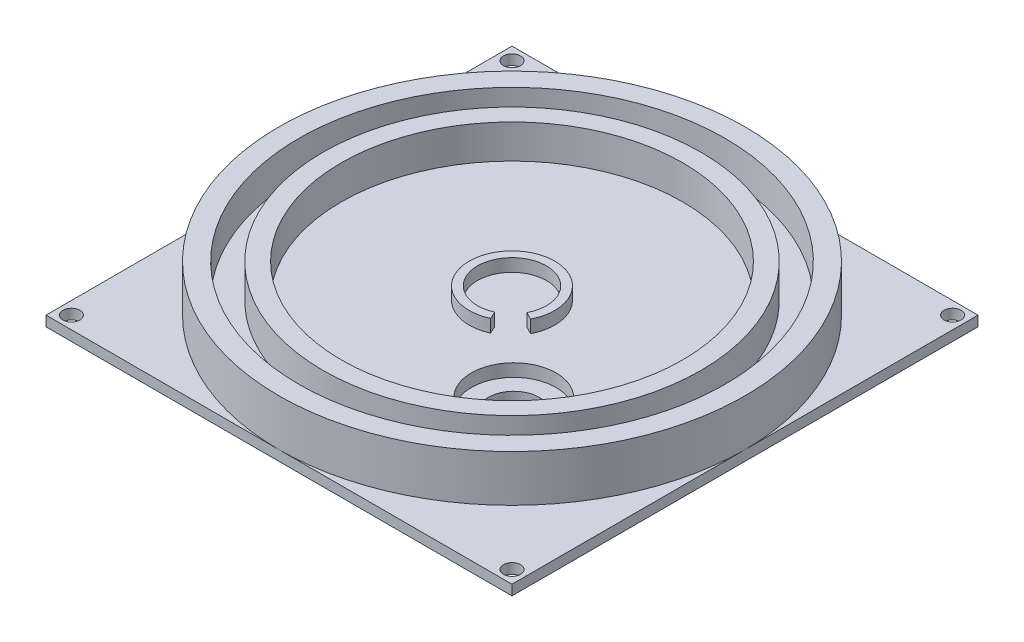
ISO-10303-21;
HEADER;
FILE_DESCRIPTION(('STEP AP214'),'2;1');
FILE_NAME('part.step','',(''),(''),'','','');
FILE_SCHEMA(('AUTOMOTIVE_DESIGN { 1 0 10303 214 1 1 1 1 }'));
ENDSEC;
DATA;
#1=APPLICATION_CONTEXT('core data for automotive mechanical design processes');
#2=APPLICATION_PROTOCOL_DEFINITION('international standard','automotive_design',2000,#1);
#3=PRODUCT_CONTEXT('',#1,'mechanical');
#4=PRODUCT('Part','Part','',(#3));
#5=PRODUCT_RELATED_PRODUCT_CATEGORY('part','',(#4));
#6=PRODUCT_DEFINITION_FORMATION('','',#4);
#7=PRODUCT_DEFINITION_CONTEXT('part definition',#1,'design');
#8=PRODUCT_DEFINITION('design','',#6,#7);
#9=PRODUCT_DEFINITION_SHAPE('','',#8);
#10=(LENGTH_UNIT() NAMED_UNIT(*) SI_UNIT(.MILLI.,.METRE.));
#11=(NAMED_UNIT(*) PLANE_ANGLE_UNIT() SI_UNIT($,.RADIAN.));
#12=(NAMED_UNIT(*) SI_UNIT($,.STERADIAN.) SOLID_ANGLE_UNIT());
#13=UNCERTAINTY_MEASURE_WITH_UNIT(LENGTH_MEASURE(1.E-05),#10,'distance_accuracy_value','');
#14=(GEOMETRIC_REPRESENTATION_CONTEXT(3) GLOBAL_UNCERTAINTY_ASSIGNED_CONTEXT((#13)) GLOBAL_UNIT_ASSIGNED_CONTEXT((#10,
#11,#12)) REPRESENTATION_CONTEXT('',''));
#15=CARTESIAN_POINT('',(0.,0.,0.));
#16=DIRECTION('',(0.,0.,1.));
#17=DIRECTION('',(1.,0.,0.));
#18=AXIS2_PLACEMENT_3D('',#15,#16,#17);
#19=CARTESIAN_POINT('',(0.,3.81,0.));
#20=DIRECTION('',(0.,-1.,0.));
#21=DIRECTION('',(0.,0.,-1.));
#22=AXIS2_PLACEMENT_3D('',#19,#20,#21);
#23=CYLINDRICAL_SURFACE('',#22,69.85);
#24=CARTESIAN_POINT('',(0.,0.,0.));
#25=DIRECTION('',(0.,1.,0.));
#26=DIRECTION('',(0.,0.,1.));
#27=AXIS2_PLACEMENT_3D('',#24,#25,#26);
#28=CIRCLE('',#27,69.85);
#29=CARTESIAN_POINT('',(0.,0.,69.85));
#30=VERTEX_POINT('',#29);
#31=CARTESIAN_POINT('',(69.85,0.,0.));
#32=VERTEX_POINT('',#31);
#33=EDGE_CURVE('E196',#30,#32,#28,.T.);
#34=ORIENTED_EDGE('',*,*,#33,.T.);
#35=CARTESIAN_POINT('',(0.,0.,-69.85));
#36=VERTEX_POINT('',#35);
#37=EDGE_CURVE('E200',#32,#36,#28,.T.);
#38=ORIENTED_EDGE('',*,*,#37,.T.);
#39=CARTESIAN_POINT('',(-69.85,0.,0.));
#40=VERTEX_POINT('',#39);
#41=EDGE_CURVE('E372',#36,#40,#28,.T.);
#42=ORIENTED_EDGE('',*,*,#41,.T.);
#43=EDGE_CURVE('E195',#40,#30,#28,.T.);
#44=ORIENTED_EDGE('',*,*,#43,.T.);
#45=EDGE_LOOP('',(#34,#38,#42,#44));
#46=FACE_BOUND('',#45,.T.);
#47=CARTESIAN_POINT('',(0.,13.97,0.));
#48=DIRECTION('',(0.,1.,0.));
#49=DIRECTION('',(0.,0.,1.));
#50=AXIS2_PLACEMENT_3D('',#47,#48,#49);
#51=CIRCLE('',#50,69.85);
#52=CARTESIAN_POINT('',(0.,13.97,69.85));
#53=VERTEX_POINT('',#52);
#54=EDGE_CURVE('E192',#53,#53,#51,.T.);
#55=ORIENTED_EDGE('',*,*,#54,.F.);
#56=EDGE_LOOP('',(#55));
#57=FACE_BOUND('',#56,.T.);
#58=ADVANCED_FACE('F41',(#46,#57),#23,.T.);
#59=CARTESIAN_POINT('',(0.,13.97,0.));
#60=DIRECTION('',(0.,-1.,0.));
#61=DIRECTION('',(0.,0.,-1.));
#62=AXIS2_PLACEMENT_3D('',#59,#60,#61);
#63=CYLINDRICAL_SURFACE('',#62,63.881);
#64=CARTESIAN_POINT('',(0.,13.97,0.));
#65=DIRECTION('',(0.,1.,0.));
#66=DIRECTION('',(0.,0.,1.));
#67=AXIS2_PLACEMENT_3D('',#64,#65,#66);
#68=CIRCLE('',#67,63.881);
#69=CARTESIAN_POINT('',(0.,13.97,63.881));
#70=VERTEX_POINT('',#69);
#71=EDGE_CURVE('E187',#70,#70,#68,.T.);
#72=ORIENTED_EDGE('',*,*,#71,.T.);
#73=EDGE_LOOP('',(#72));
#74=FACE_BOUND('',#73,.T.);
#75=CARTESIAN_POINT('',(0.,3.81,0.));
#76=DIRECTION('',(0.,1.,0.));
#77=DIRECTION('',(0.,0.,1.));
#78=AXIS2_PLACEMENT_3D('',#75,#76,#77);
#79=CIRCLE('',#78,63.881);
#80=CARTESIAN_POINT('',(0.,3.81,63.881));
#81=VERTEX_POINT('',#80);
#82=EDGE_CURVE('E199',#81,#81,#79,.F.);
#83=ORIENTED_EDGE('',*,*,#82,.T.);
#84=EDGE_LOOP('',(#83));
#85=FACE_BOUND('',#84,.T.);
#86=ADVANCED_FACE('F231',(#74,#85),#63,.F.);
#87=CARTESIAN_POINT('',(0.,13.97,0.));
#88=DIRECTION('',(0.,1.,0.));
#89=DIRECTION('',(0.,0.,1.));
#90=AXIS2_PLACEMENT_3D('',#87,#88,#89);
#91=PLANE('',#90);
#92=ORIENTED_EDGE('',*,*,#71,.F.);
#93=EDGE_LOOP('',(#92));
#94=FACE_BOUND('',#93,.T.);
#95=ORIENTED_EDGE('',*,*,#54,.T.);
#96=EDGE_LOOP('',(#95));
#97=FACE_BOUND('',#96,.T.);
#98=ADVANCED_FACE('F228',(#94,#97),#91,.T.);
#99=CARTESIAN_POINT('',(0.,3.81,0.));
#100=DIRECTION('',(0.,1.,0.));
#101=DIRECTION('',(0.,0.,1.));
#102=AXIS2_PLACEMENT_3D('',#99,#100,#101);
#103=PLANE('',#102);
#104=CARTESIAN_POINT('',(0.,3.81,0.));
#105=DIRECTION('',(0.,1.,0.));
#106=DIRECTION('',(0.,0.,1.));
#107=AXIS2_PLACEMENT_3D('',#104,#105,#106);
#108=CIRCLE('',#107,56.6547);
#109=CARTESIAN_POINT('',(0.,3.81,56.6547));
#110=VERTEX_POINT('',#109);
#111=EDGE_CURVE('E178',#110,#110,#108,.T.);
#112=ORIENTED_EDGE('',*,*,#111,.F.);
#113=EDGE_LOOP('',(#112));
#114=FACE_BOUND('',#113,.T.);
#115=ORIENTED_EDGE('',*,*,#82,.F.);
#116=EDGE_LOOP('',(#115));
#117=FACE_BOUND('',#116,.T.);
#118=ADVANCED_FACE('F212',(#114,#117),#103,.T.);
#119=CARTESIAN_POINT('',(0.,13.97,0.));
#120=DIRECTION('',(0.,-1.,0.));
#121=DIRECTION('',(0.,0.,-1.));
#122=AXIS2_PLACEMENT_3D('',#119,#120,#121);
#123=CYLINDRICAL_SURFACE('',#122,51.181);
#124=CARTESIAN_POINT('',(0.,13.97,0.));
#125=DIRECTION('',(0.,1.,0.));
#126=DIRECTION('',(0.,0.,1.));
#127=AXIS2_PLACEMENT_3D('',#124,#125,#126);
#128=CIRCLE('',#127,51.181);
#129=CARTESIAN_POINT('',(0.,13.97,51.181));
#130=VERTEX_POINT('',#129);
#131=EDGE_CURVE('E181',#130,#130,#128,.T.);
#132=ORIENTED_EDGE('',*,*,#131,.T.);
#133=EDGE_LOOP('',(#132));
#134=FACE_BOUND('',#133,.T.);
#135=CARTESIAN_POINT('',(0.,3.81,0.));
#136=DIRECTION('',(0.,1.,0.));
#137=DIRECTION('',(0.,0.,1.));
#138=AXIS2_PLACEMENT_3D('',#135,#136,#137);
#139=CIRCLE('',#138,51.181);
#140=CARTESIAN_POINT('',(0.,3.81,51.181));
#141=VERTEX_POINT('',#140);
#142=EDGE_CURVE('E48',#141,#141,#139,.F.);
#143=ORIENTED_EDGE('',*,*,#142,.T.);
#144=EDGE_LOOP('',(#143));
#145=FACE_BOUND('',#144,.T.);
#146=ADVANCED_FACE('F205',(#134,#145),#123,.F.);
#147=CARTESIAN_POINT('',(0.,13.97,0.));
#148=DIRECTION('',(0.,-1.,0.));
#149=DIRECTION('',(0.,0.,-1.));
#150=AXIS2_PLACEMENT_3D('',#147,#148,#149);
#151=CYLINDRICAL_SURFACE('',#150,56.6547);
#152=CARTESIAN_POINT('',(0.,13.97,0.));
#153=DIRECTION('',(0.,1.,0.));
#154=DIRECTION('',(0.,0.,1.));
#155=AXIS2_PLACEMENT_3D('',#152,#153,#154);
#156=CIRCLE('',#155,56.6547);
#157=CARTESIAN_POINT('',(0.,13.97,56.6547));
#158=VERTEX_POINT('',#157);
#159=EDGE_CURVE('E184',#158,#158,#156,.T.);
#160=ORIENTED_EDGE('',*,*,#159,.F.);
#161=EDGE_LOOP('',(#160));
#162=FACE_BOUND('',#161,.T.);
#163=ORIENTED_EDGE('',*,*,#111,.T.);
#164=EDGE_LOOP('',(#163));
#165=FACE_BOUND('',#164,.T.);
#166=ADVANCED_FACE('F222',(#162,#165),#151,.T.);
#167=CARTESIAN_POINT('',(0.,13.97,0.));
#168=DIRECTION('',(0.,1.,0.));
#169=DIRECTION('',(0.,0.,1.));
#170=AXIS2_PLACEMENT_3D('',#167,#168,#169);
#171=PLANE('',#170);
#172=ORIENTED_EDGE('',*,*,#131,.F.);
#173=EDGE_LOOP('',(#172));
#174=FACE_BOUND('',#173,.T.);
#175=ORIENTED_EDGE('',*,*,#159,.T.);
#176=EDGE_LOOP('',(#175));
#177=FACE_BOUND('',#176,.T.);
#178=ADVANCED_FACE('F210',(#174,#177),#171,.T.);
#179=CARTESIAN_POINT('',(25.4,3.81,24.8868157866771));
#180=DIRECTION('',(0.,1.,0.));
#181=DIRECTION('',(0.,0.,1.));
#182=AXIS2_PLACEMENT_3D('',#179,#180,#181);
#183=CIRCLE('',#182,12.7);
#184=CARTESIAN_POINT('',(25.4,3.81,37.5868157866771));
#185=VERTEX_POINT('',#184);
#186=EDGE_CURVE('E142',#185,#185,#183,.T.);
#187=ORIENTED_EDGE('',*,*,#186,.F.);
#188=EDGE_LOOP('',(#187));
#189=FACE_BOUND('',#188,.T.);
#190=CARTESIAN_POINT('',(0.,3.81,0.));
#191=DIRECTION('',(0.,1.,0.));
#192=DIRECTION('',(0.,0.,1.));
#193=AXIS2_PLACEMENT_3D('',#190,#191,#192);
#194=CIRCLE('',#193,12.827);
#195=CARTESIAN_POINT('',(11.4155046550264,3.81,5.84963096879375));
#196=VERTEX_POINT('',#195);
#197=CARTESIAN_POINT('',(5.2592013762278,3.81,11.6992619375875));
#198=VERTEX_POINT('',#197);
#199=EDGE_CURVE('E174',#196,#198,#194,.T.);
#200=ORIENTED_EDGE('',*,*,#199,.F.);
#201=DIRECTION('',(-0.889959043815887,0.,-0.456040459093611));
#202=VECTOR('',#201,1.);
#203=CARTESIAN_POINT('',(9.20021860315988,3.81,4.71445505801793));
#204=LINE('',#203,#202);
#205=CARTESIAN_POINT('',(9.20021860315988,3.81,4.71445505801793));
#206=VERTEX_POINT('',#205);
#207=EDGE_CURVE('E63',#196,#206,#204,.T.);
#208=ORIENTED_EDGE('',*,*,#207,.T.);
#209=CARTESIAN_POINT('',(0.,3.81,0.));
#210=DIRECTION('',(0.,1.,0.));
#211=DIRECTION('',(0.,0.,1.));
#212=AXIS2_PLACEMENT_3D('',#209,#210,#211);
#213=CIRCLE('',#212,10.3378);
#214=CARTESIAN_POINT('',(4.23860388143508,3.81,9.42891011603587));
#215=VERTEX_POINT('',#214);
#216=EDGE_CURVE('E12',#215,#206,#213,.F.);
#217=ORIENTED_EDGE('',*,*,#216,.F.);
#218=DIRECTION('',(0.410010242163234,0.,0.912080918187222));
#219=VECTOR('',#218,1.);
#220=CARTESIAN_POINT('',(4.23860388143508,3.81,9.42891011603587));
#221=LINE('',#220,#219);
#222=EDGE_CURVE('E155',#215,#198,#221,.T.);
#223=ORIENTED_EDGE('',*,*,#222,.T.);
#224=EDGE_LOOP('',(#200,#208,#217,#223));
#225=FACE_BOUND('',#224,.T.);
#226=ORIENTED_EDGE('',*,*,#142,.F.);
#227=EDGE_LOOP('',(#226));
#228=FACE_BOUND('',#227,.T.);
#229=ADVANCED_FACE('F207',(#189,#225,#228),#103,.T.);
#230=CARTESIAN_POINT('',(0.,7.62,0.));
#231=DIRECTION('',(0.,1.,0.));
#232=DIRECTION('',(0.,0.,1.));
#233=AXIS2_PLACEMENT_3D('',#230,#231,#232);
#234=PLANE('',#233);
#235=DIRECTION('',(0.410010242163234,0.,0.912080918187222));
#236=VECTOR('',#235,1.);
#237=CARTESIAN_POINT('',(4.23860388143508,7.62,9.42891011603587));
#238=LINE('',#237,#236);
#239=CARTESIAN_POINT('',(4.23860388143508,7.62,9.42891011603587));
#240=VERTEX_POINT('',#239);
#241=CARTESIAN_POINT('',(5.2592013762278,7.62,11.6992619375875));
#242=VERTEX_POINT('',#241);
#243=EDGE_CURVE('E156',#240,#242,#238,.T.);
#244=ORIENTED_EDGE('',*,*,#243,.F.);
#245=CARTESIAN_POINT('',(0.,7.62,0.));
#246=DIRECTION('',(0.,1.,0.));
#247=DIRECTION('',(0.,0.,1.));
#248=AXIS2_PLACEMENT_3D('',#245,#246,#247);
#249=CIRCLE('',#248,10.3378);
#250=CARTESIAN_POINT('',(9.20021860315988,7.62,4.71445505801793));
#251=VERTEX_POINT('',#250);
#252=EDGE_CURVE('E165',#251,#240,#249,.T.);
#253=ORIENTED_EDGE('',*,*,#252,.F.);
#254=DIRECTION('',(-0.889959043815887,0.,-0.456040459093611));
#255=VECTOR('',#254,1.);
#256=CARTESIAN_POINT('',(9.20021860315988,7.62,4.71445505801793));
#257=LINE('',#256,#255);
#258=CARTESIAN_POINT('',(11.4155046550264,7.62,5.84963096879375));
#259=VERTEX_POINT('',#258);
#260=EDGE_CURVE('E153',#259,#251,#257,.T.);
#261=ORIENTED_EDGE('',*,*,#260,.F.);
#262=CARTESIAN_POINT('',(0.,7.62,0.));
#263=DIRECTION('',(0.,1.,0.));
#264=DIRECTION('',(0.,0.,1.));
#265=AXIS2_PLACEMENT_3D('',#262,#263,#264);
#266=CIRCLE('',#265,12.827);
#267=EDGE_CURVE('E175',#259,#242,#266,.T.);
#268=ORIENTED_EDGE('',*,*,#267,.T.);
#269=EDGE_LOOP('',(#244,#253,#261,#268));
#270=FACE_BOUND('',#269,.T.);
#271=ADVANCED_FACE('F209',(#270),#234,.T.);
#272=CARTESIAN_POINT('',(0.,7.62,0.));
#273=DIRECTION('',(0.,-1.,0.));
#274=DIRECTION('',(0.,0.,-1.));
#275=AXIS2_PLACEMENT_3D('',#272,#273,#274);
#276=CYLINDRICAL_SURFACE('',#275,12.827);
#277=ORIENTED_EDGE('',*,*,#199,.T.);
#278=DIRECTION('',(0.,1.,0.));
#279=VECTOR('',#278,1.);
#280=CARTESIAN_POINT('',(5.2592013762278,3.81,11.6992619375875));
#281=LINE('',#280,#279);
#282=EDGE_CURVE('E162',#198,#242,#281,.T.);
#283=ORIENTED_EDGE('',*,*,#282,.T.);
#284=ORIENTED_EDGE('',*,*,#267,.F.);
#285=DIRECTION('',(0.,1.,0.));
#286=VECTOR('',#285,1.);
#287=CARTESIAN_POINT('',(11.4155046550264,3.81,5.84963096879375));
#288=LINE('',#287,#286);
#289=EDGE_CURVE('E159',#196,#259,#288,.T.);
#290=ORIENTED_EDGE('',*,*,#289,.F.);
#291=EDGE_LOOP('',(#277,#283,#284,#290));
#292=FACE_BOUND('',#291,.T.);
#293=ADVANCED_FACE('F218',(#292),#276,.T.);
#294=CARTESIAN_POINT('',(0.,7.62,0.));
#295=DIRECTION('',(0.,-1.,0.));
#296=DIRECTION('',(0.,0.,-1.));
#297=AXIS2_PLACEMENT_3D('',#294,#295,#296);
#298=CYLINDRICAL_SURFACE('',#297,10.3378);
#299=DIRECTION('',(0.,1.,0.));
#300=VECTOR('',#299,1.);
#301=CARTESIAN_POINT('',(4.23860388143508,3.81,9.42891011603587));
#302=LINE('',#301,#300);
#303=EDGE_CURVE('E166',#215,#240,#302,.T.);
#304=ORIENTED_EDGE('',*,*,#303,.F.);
#305=ORIENTED_EDGE('',*,*,#216,.T.);
#306=DIRECTION('',(0.,1.,0.));
#307=VECTOR('',#306,1.);
#308=CARTESIAN_POINT('',(9.20021860315988,3.81,4.71445505801793));
#309=LINE('',#308,#307);
#310=EDGE_CURVE('E168',#206,#251,#309,.T.);
#311=ORIENTED_EDGE('',*,*,#310,.T.);
#312=ORIENTED_EDGE('',*,*,#252,.T.);
#313=EDGE_LOOP('',(#304,#305,#311,#312));
#314=FACE_BOUND('',#313,.T.);
#315=ADVANCED_FACE('F258',(#314),#298,.F.);
#316=CARTESIAN_POINT('',(4.23860388143508,3.81,9.42891011603587));
#317=DIRECTION('',(-0.912080918187222,0.,0.410010242163234));
#318=DIRECTION('',(0.410010242163234,0.,0.912080918187222));
#319=AXIS2_PLACEMENT_3D('',#316,#317,#318);
#320=PLANE('',#319);
#321=ORIENTED_EDGE('',*,*,#243,.T.);
#322=ORIENTED_EDGE('',*,*,#282,.F.);
#323=ORIENTED_EDGE('',*,*,#222,.F.);
#324=ORIENTED_EDGE('',*,*,#303,.T.);
#325=EDGE_LOOP('',(#321,#322,#323,#324));
#326=FACE_BOUND('',#325,.T.);
#327=ADVANCED_FACE('F263',(#326),#320,.F.);
#328=CARTESIAN_POINT('',(9.20021860315988,3.81,4.71445505801793));
#329=DIRECTION('',(0.456040459093611,0.,-0.889959043815887));
#330=DIRECTION('',(-0.889959043815888,0.,-0.456040459093611));
#331=AXIS2_PLACEMENT_3D('',#328,#329,#330);
#332=PLANE('',#331);
#333=ORIENTED_EDGE('',*,*,#260,.T.);
#334=ORIENTED_EDGE('',*,*,#310,.F.);
#335=ORIENTED_EDGE('',*,*,#207,.F.);
#336=ORIENTED_EDGE('',*,*,#289,.T.);
#337=EDGE_LOOP('',(#333,#334,#335,#336));
#338=FACE_BOUND('',#337,.T.);
#339=ADVANCED_FACE('F265',(#338),#332,.F.);
#340=CARTESIAN_POINT('',(25.4,-6.35,24.8868157866771));
#341=DIRECTION('',(0.,1.,0.));
#342=DIRECTION('',(0.,0.,1.));
#343=AXIS2_PLACEMENT_3D('',#340,#341,#342);
#344=CYLINDRICAL_SURFACE('',#343,12.7);
#345=ORIENTED_EDGE('',*,*,#186,.T.);
#346=EDGE_LOOP('',(#345));
#347=FACE_BOUND('',#346,.T.);
#348=CARTESIAN_POINT('',(25.4,0.,24.8868157866771));
#349=DIRECTION('',(0.,1.,0.));
#350=DIRECTION('',(0.,0.,1.));
#351=AXIS2_PLACEMENT_3D('',#348,#349,#350);
#352=CIRCLE('',#351,12.7);
#353=CARTESIAN_POINT('',(25.4,0.,37.5868157866771));
#354=VERTEX_POINT('',#353);
#355=EDGE_CURVE('E145',#354,#354,#352,.T.);
#356=ORIENTED_EDGE('',*,*,#355,.F.);
#357=EDGE_LOOP('',(#356));
#358=FACE_BOUND('',#357,.T.);
#359=ADVANCED_FACE('F268',(#347,#358),#344,.F.);
#360=CARTESIAN_POINT('',(0.,0.,0.));
#361=DIRECTION('',(0.,-1.,0.));
#362=DIRECTION('',(0.,0.,-1.));
#363=AXIS2_PLACEMENT_3D('',#360,#361,#362);
#364=PLANE('',#363);
#365=CARTESIAN_POINT('',(-66.04,0.,66.04));
#366=DIRECTION('',(0.,1.,0.));
#367=DIRECTION('',(0.,0.,1.));
#368=AXIS2_PLACEMENT_3D('',#365,#366,#367);
#369=CIRCLE('',#368,2.53999999999999);
#370=CARTESIAN_POINT('',(-66.04,0.,68.58));
#371=VERTEX_POINT('',#370);
#372=EDGE_CURVE('E324',#371,#371,#369,.T.);
#373=ORIENTED_EDGE('',*,*,#372,.F.);
#374=EDGE_LOOP('',(#373));
#375=FACE_BOUND('',#374,.T.);
#376=ORIENTED_EDGE('',*,*,#43,.F.);
#377=DIRECTION('',(0.,0.,-1.));
#378=VECTOR('',#377,1.);
#379=CARTESIAN_POINT('',(-69.85,0.,69.85));
#380=LINE('',#379,#378);
#381=CARTESIAN_POINT('',(-69.85,0.,69.85));
#382=VERTEX_POINT('',#381);
#383=EDGE_CURVE('E360',#382,#40,#380,.T.);
#384=ORIENTED_EDGE('',*,*,#383,.F.);
#385=DIRECTION('',(-1.,0.,0.));
#386=VECTOR('',#385,1.);
#387=CARTESIAN_POINT('',(-69.85,0.,69.85));
#388=LINE('',#387,#386);
#389=EDGE_CURVE('E357',#30,#382,#388,.T.);
#390=ORIENTED_EDGE('',*,*,#389,.F.);
#391=EDGE_LOOP('',(#376,#384,#390));
#392=FACE_BOUND('',#391,.T.);
#393=ADVANCED_FACE('F275',(#375,#392),#364,.F.);
#394=CARTESIAN_POINT('',(0.,-3.048,0.));
#395=DIRECTION('',(0.,-1.,0.));
#396=DIRECTION('',(0.,0.,-1.));
#397=AXIS2_PLACEMENT_3D('',#394,#395,#396);
#398=PLANE('',#397);
#399=CARTESIAN_POINT('',(-66.04,-3.048,-66.04));
#400=DIRECTION('',(0.,1.,0.));
#401=DIRECTION('',(0.,0.,1.));
#402=AXIS2_PLACEMENT_3D('',#399,#400,#401);
#403=CIRCLE('',#402,2.53999999999999);
#404=CARTESIAN_POINT('',(-66.04,-3.048,-63.5));
#405=VERTEX_POINT('',#404);
#406=EDGE_CURVE('E341',#405,#405,#403,.T.);
#407=ORIENTED_EDGE('',*,*,#406,.T.);
#408=EDGE_LOOP('',(#407));
#409=FACE_BOUND('',#408,.T.);
#410=CARTESIAN_POINT('',(66.04,-3.048,-66.04));
#411=DIRECTION('',(0.,1.,0.));
#412=DIRECTION('',(0.,0.,1.));
#413=AXIS2_PLACEMENT_3D('',#410,#411,#412);
#414=CIRCLE('',#413,2.53999999999999);
#415=CARTESIAN_POINT('',(66.04,-3.048,-63.5));
#416=VERTEX_POINT('',#415);
#417=EDGE_CURVE('E335',#416,#416,#414,.T.);
#418=ORIENTED_EDGE('',*,*,#417,.T.);
#419=EDGE_LOOP('',(#418));
#420=FACE_BOUND('',#419,.T.);
#421=CARTESIAN_POINT('',(66.04,-3.048,66.04));
#422=DIRECTION('',(0.,1.,0.));
#423=DIRECTION('',(0.,0.,1.));
#424=AXIS2_PLACEMENT_3D('',#421,#422,#423);
#425=CIRCLE('',#424,2.53999999999999);
#426=CARTESIAN_POINT('',(66.04,-3.048,68.58));
#427=VERTEX_POINT('',#426);
#428=EDGE_CURVE('E325',#427,#427,#425,.T.);
#429=ORIENTED_EDGE('',*,*,#428,.T.);
#430=EDGE_LOOP('',(#429));
#431=FACE_BOUND('',#430,.T.);
#432=CARTESIAN_POINT('',(-66.04,-3.048,66.04));
#433=DIRECTION('',(0.,1.,0.));
#434=DIRECTION('',(0.,0.,1.));
#435=AXIS2_PLACEMENT_3D('',#432,#433,#434);
#436=CIRCLE('',#435,2.53999999999999);
#437=CARTESIAN_POINT('',(-66.04,-3.048,68.58));
#438=VERTEX_POINT('',#437);
#439=EDGE_CURVE('E321',#438,#438,#436,.T.);
#440=ORIENTED_EDGE('',*,*,#439,.T.);
#441=EDGE_LOOP('',(#440));
#442=FACE_BOUND('',#441,.T.);
#443=CARTESIAN_POINT('',(25.4,-3.048,24.8868157866771));
#444=DIRECTION('',(0.,1.,0.));
#445=DIRECTION('',(0.,0.,1.));
#446=AXIS2_PLACEMENT_3D('',#443,#444,#445);
#447=CIRCLE('',#446,7.62);
#448=CARTESIAN_POINT('',(25.4,-3.048,32.5068157866771));
#449=VERTEX_POINT('',#448);
#450=EDGE_CURVE('E347',#449,#449,#447,.T.);
#451=ORIENTED_EDGE('',*,*,#450,.T.);
#452=EDGE_LOOP('',(#451));
#453=FACE_BOUND('',#452,.T.);
#454=DIRECTION('',(0.,0.,1.));
#455=VECTOR('',#454,1.);
#456=CARTESIAN_POINT('',(69.85,-3.048,69.85));
#457=LINE('',#456,#455);
#458=CARTESIAN_POINT('',(69.85,-3.048,-69.85));
#459=VERTEX_POINT('',#458);
#460=CARTESIAN_POINT('',(69.85,-3.048,69.85));
#461=VERTEX_POINT('',#460);
#462=EDGE_CURVE('E127',#459,#461,#457,.T.);
#463=ORIENTED_EDGE('',*,*,#462,.T.);
#464=DIRECTION('',(-1.,0.,0.));
#465=VECTOR('',#464,1.);
#466=CARTESIAN_POINT('',(-69.85,-3.048,69.85));
#467=LINE('',#466,#465);
#468=CARTESIAN_POINT('',(-69.85,-3.048,69.85));
#469=VERTEX_POINT('',#468);
#470=EDGE_CURVE('E117',#461,#469,#467,.T.);
#471=ORIENTED_EDGE('',*,*,#470,.T.);
#472=DIRECTION('',(0.,0.,-1.));
#473=VECTOR('',#472,1.);
#474=CARTESIAN_POINT('',(-69.85,-3.048,69.85));
#475=LINE('',#474,#473);
#476=CARTESIAN_POINT('',(-69.85,-3.048,-69.85));
#477=VERTEX_POINT('',#476);
#478=EDGE_CURVE('E126',#469,#477,#475,.T.);
#479=ORIENTED_EDGE('',*,*,#478,.T.);
#480=DIRECTION('',(1.,0.,0.));
#481=VECTOR('',#480,1.);
#482=CARTESIAN_POINT('',(-69.85,-3.048,-69.85));
#483=LINE('',#482,#481);
#484=EDGE_CURVE('E132',#477,#459,#483,.T.);
#485=ORIENTED_EDGE('',*,*,#484,.T.);
#486=EDGE_LOOP('',(#463,#471,#479,#485));
#487=FACE_BOUND('',#486,.T.);
#488=ADVANCED_FACE('F130',(#409,#420,#431,#442,#453,#487),#398,.T.);
#489=CARTESIAN_POINT('',(-69.85,-3.048,-69.85));
#490=DIRECTION('',(0.,0.,1.));
#491=DIRECTION('',(1.,0.,0.));
#492=AXIS2_PLACEMENT_3D('',#489,#490,#491);
#493=PLANE('',#492);
#494=DIRECTION('',(1.,0.,0.));
#495=VECTOR('',#494,1.);
#496=CARTESIAN_POINT('',(-69.85,0.,-69.85));
#497=LINE('',#496,#495);
#498=CARTESIAN_POINT('',(-69.85,0.,-69.85));
#499=VERTEX_POINT('',#498);
#500=EDGE_CURVE('E136',#499,#36,#497,.T.);
#501=ORIENTED_EDGE('',*,*,#500,.T.);
#502=CARTESIAN_POINT('',(69.85,0.,-69.85));
#503=VERTEX_POINT('',#502);
#504=EDGE_CURVE('E363',#36,#503,#497,.T.);
#505=ORIENTED_EDGE('',*,*,#504,.T.);
#506=DIRECTION('',(0.,1.,0.));
#507=VECTOR('',#506,1.);
#508=CARTESIAN_POINT('',(69.85,-3.048,-69.85));
#509=LINE('',#508,#507);
#510=EDGE_CURVE('E354',#459,#503,#509,.T.);
#511=ORIENTED_EDGE('',*,*,#510,.F.);
#512=ORIENTED_EDGE('',*,*,#484,.F.);
#513=DIRECTION('',(0.,1.,0.));
#514=VECTOR('',#513,1.);
#515=CARTESIAN_POINT('',(-69.85,-3.048,-69.85));
#516=LINE('',#515,#514);
#517=EDGE_CURVE('E147',#477,#499,#516,.T.);
#518=ORIENTED_EDGE('',*,*,#517,.T.);
#519=EDGE_LOOP('',(#501,#505,#511,#512,#518));
#520=FACE_BOUND('',#519,.T.);
#521=ADVANCED_FACE('F285',(#520),#493,.F.);
#522=CARTESIAN_POINT('',(-69.85,-3.048,69.85));
#523=DIRECTION('',(1.,0.,0.));
#524=DIRECTION('',(0.,0.,-1.));
#525=AXIS2_PLACEMENT_3D('',#522,#523,#524);
#526=PLANE('',#525);
#527=ORIENTED_EDGE('',*,*,#383,.T.);
#528=EDGE_CURVE('E359',#40,#499,#380,.T.);
#529=ORIENTED_EDGE('',*,*,#528,.T.);
#530=ORIENTED_EDGE('',*,*,#517,.F.);
#531=ORIENTED_EDGE('',*,*,#478,.F.);
#532=DIRECTION('',(0.,1.,0.));
#533=VECTOR('',#532,1.);
#534=CARTESIAN_POINT('',(-69.85,-3.048,69.85));
#535=LINE('',#534,#533);
#536=EDGE_CURVE('E123',#469,#382,#535,.T.);
#537=ORIENTED_EDGE('',*,*,#536,.T.);
#538=EDGE_LOOP('',(#527,#529,#530,#531,#537));
#539=FACE_BOUND('',#538,.T.);
#540=ADVANCED_FACE('F282',(#539),#526,.F.);
#541=CARTESIAN_POINT('',(-69.85,-3.048,69.85));
#542=DIRECTION('',(0.,0.,-1.));
#543=DIRECTION('',(-1.,0.,0.));
#544=AXIS2_PLACEMENT_3D('',#541,#542,#543);
#545=PLANE('',#544);
#546=CARTESIAN_POINT('',(69.85,0.,69.85));
#547=VERTEX_POINT('',#546);
#548=EDGE_CURVE('E55',#547,#30,#388,.T.);
#549=ORIENTED_EDGE('',*,*,#548,.T.);
#550=ORIENTED_EDGE('',*,*,#389,.T.);
#551=ORIENTED_EDGE('',*,*,#536,.F.);
#552=ORIENTED_EDGE('',*,*,#470,.F.);
#553=DIRECTION('',(0.,1.,0.));
#554=VECTOR('',#553,1.);
#555=CARTESIAN_POINT('',(69.85,-3.048,69.85));
#556=LINE('',#555,#554);
#557=EDGE_CURVE('E121',#461,#547,#556,.T.);
#558=ORIENTED_EDGE('',*,*,#557,.T.);
#559=EDGE_LOOP('',(#549,#550,#551,#552,#558));
#560=FACE_BOUND('',#559,.T.);
#561=ADVANCED_FACE('F119',(#560),#545,.F.);
#562=CARTESIAN_POINT('',(69.85,-3.048,69.85));
#563=DIRECTION('',(-1.,0.,0.));
#564=DIRECTION('',(0.,0.,1.));
#565=AXIS2_PLACEMENT_3D('',#562,#563,#564);
#566=PLANE('',#565);
#567=DIRECTION('',(0.,0.,1.));
#568=VECTOR('',#567,1.);
#569=CARTESIAN_POINT('',(69.85,0.,69.85));
#570=LINE('',#569,#568);
#571=EDGE_CURVE('E355',#503,#32,#570,.T.);
#572=ORIENTED_EDGE('',*,*,#571,.T.);
#573=EDGE_CURVE('E141',#32,#547,#570,.T.);
#574=ORIENTED_EDGE('',*,*,#573,.T.);
#575=ORIENTED_EDGE('',*,*,#557,.F.);
#576=ORIENTED_EDGE('',*,*,#462,.F.);
#577=ORIENTED_EDGE('',*,*,#510,.T.);
#578=EDGE_LOOP('',(#572,#574,#575,#576,#577));
#579=FACE_BOUND('',#578,.T.);
#580=ADVANCED_FACE('F139',(#579),#566,.F.);
#581=CARTESIAN_POINT('',(-66.04,0.,-66.04));
#582=DIRECTION('',(0.,1.,0.));
#583=DIRECTION('',(0.,0.,1.));
#584=AXIS2_PLACEMENT_3D('',#581,#582,#583);
#585=CIRCLE('',#584,2.53999999999999);
#586=CARTESIAN_POINT('',(-66.04,0.,-63.5));
#587=VERTEX_POINT('',#586);
#588=EDGE_CURVE('E344',#587,#587,#585,.T.);
#589=ORIENTED_EDGE('',*,*,#588,.F.);
#590=EDGE_LOOP('',(#589));
#591=FACE_BOUND('',#590,.T.);
#592=ORIENTED_EDGE('',*,*,#41,.F.);
#593=ORIENTED_EDGE('',*,*,#500,.F.);
#594=ORIENTED_EDGE('',*,*,#528,.F.);
#595=EDGE_LOOP('',(#592,#593,#594));
#596=FACE_BOUND('',#595,.T.);
#597=ADVANCED_FACE('F279',(#591,#596),#364,.F.);
#598=CARTESIAN_POINT('',(66.04,0.,-66.04));
#599=DIRECTION('',(0.,1.,0.));
#600=DIRECTION('',(0.,0.,1.));
#601=AXIS2_PLACEMENT_3D('',#598,#599,#600);
#602=CIRCLE('',#601,2.53999999999999);
#603=CARTESIAN_POINT('',(66.04,0.,-63.5));
#604=VERTEX_POINT('',#603);
#605=EDGE_CURVE('E338',#604,#604,#602,.T.);
#606=ORIENTED_EDGE('',*,*,#605,.F.);
#607=EDGE_LOOP('',(#606));
#608=FACE_BOUND('',#607,.T.);
#609=ORIENTED_EDGE('',*,*,#37,.F.);
#610=ORIENTED_EDGE('',*,*,#571,.F.);
#611=ORIENTED_EDGE('',*,*,#504,.F.);
#612=EDGE_LOOP('',(#609,#610,#611));
#613=FACE_BOUND('',#612,.T.);
#614=ADVANCED_FACE('F376',(#608,#613),#364,.F.);
#615=CARTESIAN_POINT('',(66.04,0.,66.04));
#616=DIRECTION('',(0.,1.,0.));
#617=DIRECTION('',(0.,0.,1.));
#618=AXIS2_PLACEMENT_3D('',#615,#616,#617);
#619=CIRCLE('',#618,2.53999999999999);
#620=CARTESIAN_POINT('',(66.04,0.,68.58));
#621=VERTEX_POINT('',#620);
#622=EDGE_CURVE('E330',#621,#621,#619,.T.);
#623=ORIENTED_EDGE('',*,*,#622,.F.);
#624=EDGE_LOOP('',(#623));
#625=FACE_BOUND('',#624,.T.);
#626=ORIENTED_EDGE('',*,*,#33,.F.);
#627=ORIENTED_EDGE('',*,*,#548,.F.);
#628=ORIENTED_EDGE('',*,*,#573,.F.);
#629=EDGE_LOOP('',(#626,#627,#628));
#630=FACE_BOUND('',#629,.T.);
#631=ADVANCED_FACE('F378',(#625,#630),#364,.F.);
#632=CARTESIAN_POINT('',(25.4,0.,24.8868157866771));
#633=DIRECTION('',(0.,1.,0.));
#634=DIRECTION('',(0.,0.,1.));
#635=AXIS2_PLACEMENT_3D('',#632,#633,#634);
#636=CIRCLE('',#635,7.62);
#637=CARTESIAN_POINT('',(25.4,0.,32.5068157866771));
#638=VERTEX_POINT('',#637);
#639=EDGE_CURVE('E327',#638,#638,#636,.T.);
#640=ORIENTED_EDGE('',*,*,#639,.F.);
#641=EDGE_LOOP('',(#640));
#642=FACE_BOUND('',#641,.T.);
#643=ORIENTED_EDGE('',*,*,#355,.T.);
#644=EDGE_LOOP('',(#643));
#645=FACE_BOUND('',#644,.T.);
#646=ADVANCED_FACE('F293',(#642,#645),#364,.F.);
#647=CARTESIAN_POINT('',(66.04,-3.048,66.04));
#648=DIRECTION('',(0.,1.,0.));
#649=DIRECTION('',(0.,0.,1.));
#650=AXIS2_PLACEMENT_3D('',#647,#648,#649);
#651=CYLINDRICAL_SURFACE('',#650,2.53999999999999);
#652=ORIENTED_EDGE('',*,*,#428,.F.);
#653=EDGE_LOOP('',(#652));
#654=FACE_BOUND('',#653,.T.);
#655=ORIENTED_EDGE('',*,*,#622,.T.);
#656=EDGE_LOOP('',(#655));
#657=FACE_BOUND('',#656,.T.);
#658=ADVANCED_FACE('F309',(#654,#657),#651,.F.);
#659=CARTESIAN_POINT('',(66.04,-3.048,-66.04));
#660=DIRECTION('',(0.,1.,0.));
#661=DIRECTION('',(0.,0.,1.));
#662=AXIS2_PLACEMENT_3D('',#659,#660,#661);
#663=CYLINDRICAL_SURFACE('',#662,2.53999999999999);
#664=ORIENTED_EDGE('',*,*,#417,.F.);
#665=EDGE_LOOP('',(#664));
#666=FACE_BOUND('',#665,.T.);
#667=ORIENTED_EDGE('',*,*,#605,.T.);
#668=EDGE_LOOP('',(#667));
#669=FACE_BOUND('',#668,.T.);
#670=ADVANCED_FACE('F305',(#666,#669),#663,.F.);
#671=CARTESIAN_POINT('',(-66.04,-3.048,-66.04));
#672=DIRECTION('',(0.,1.,0.));
#673=DIRECTION('',(0.,0.,1.));
#674=AXIS2_PLACEMENT_3D('',#671,#672,#673);
#675=CYLINDRICAL_SURFACE('',#674,2.53999999999999);
#676=ORIENTED_EDGE('',*,*,#406,.F.);
#677=EDGE_LOOP('',(#676));
#678=FACE_BOUND('',#677,.T.);
#679=ORIENTED_EDGE('',*,*,#588,.T.);
#680=EDGE_LOOP('',(#679));
#681=FACE_BOUND('',#680,.T.);
#682=ADVANCED_FACE('F301',(#678,#681),#675,.F.);
#683=CARTESIAN_POINT('',(25.4,-3.048,24.8868157866771));
#684=DIRECTION('',(0.,1.,0.));
#685=DIRECTION('',(0.,0.,1.));
#686=AXIS2_PLACEMENT_3D('',#683,#684,#685);
#687=CYLINDRICAL_SURFACE('',#686,7.62);
#688=ORIENTED_EDGE('',*,*,#450,.F.);
#689=EDGE_LOOP('',(#688));
#690=FACE_BOUND('',#689,.T.);
#691=ORIENTED_EDGE('',*,*,#639,.T.);
#692=EDGE_LOOP('',(#691));
#693=FACE_BOUND('',#692,.T.);
#694=ADVANCED_FACE('F297',(#690,#693),#687,.F.);
#695=CARTESIAN_POINT('',(-66.04,-3.048,66.04));
#696=DIRECTION('',(0.,1.,0.));
#697=DIRECTION('',(0.,0.,1.));
#698=AXIS2_PLACEMENT_3D('',#695,#696,#697);
#699=CYLINDRICAL_SURFACE('',#698,2.53999999999999);
#700=ORIENTED_EDGE('',*,*,#439,.F.);
#701=EDGE_LOOP('',(#700));
#702=FACE_BOUND('',#701,.T.);
#703=ORIENTED_EDGE('',*,*,#372,.T.);
#704=EDGE_LOOP('',(#703));
#705=FACE_BOUND('',#704,.T.);
#706=ADVANCED_FACE('F300',(#702,#705),#699,.F.);
#707=CLOSED_SHELL('',(#58,#86,#98,#118,#146,#166,#178,#229,#271,#293,#315,#327,#339,#359,#393,
#488,#521,#540,#561,#580,#597,#614,#631,#646,#658,#670,#682,#694,#706));
#708=MANIFOLD_SOLID_BREP('B2',#707);
#709=ADVANCED_BREP_SHAPE_REPRESENTATION('',(#18,#708),#14);
#710=SHAPE_DEFINITION_REPRESENTATION(#9,#709);
ENDSEC;
END-ISO-10303-21;
